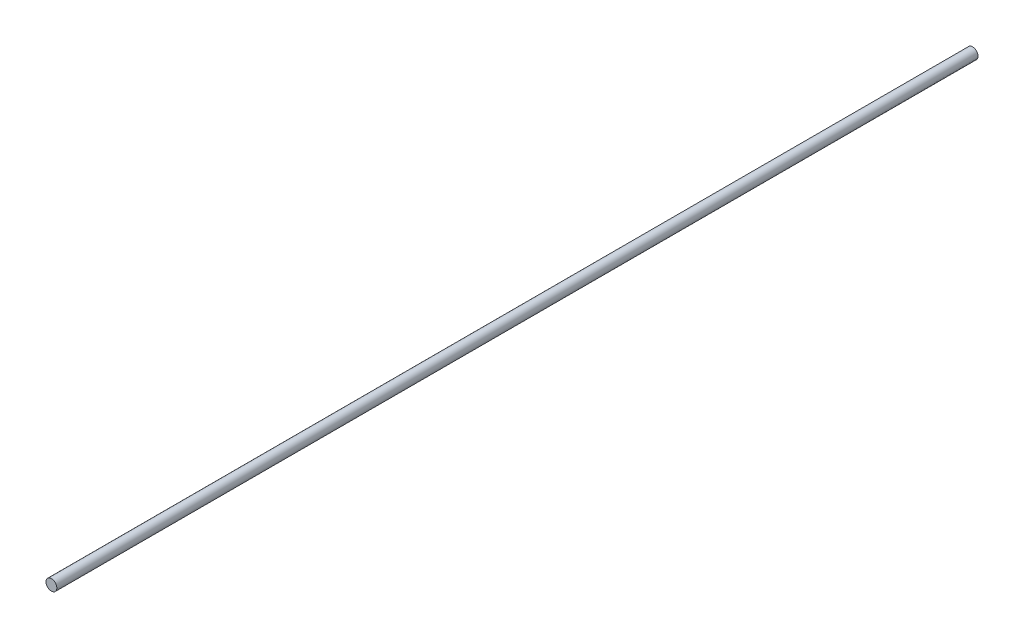
ISO-10303-21;
HEADER;
FILE_DESCRIPTION(('STEP AP214'),'2;1');
FILE_NAME('part.step','',(''),(''),'','','');
FILE_SCHEMA(('AUTOMOTIVE_DESIGN { 1 0 10303 214 1 1 1 1 }'));
ENDSEC;
DATA;
#1=APPLICATION_CONTEXT('core data for automotive mechanical design processes');
#2=APPLICATION_PROTOCOL_DEFINITION('international standard','automotive_design',2000,#1);
#3=PRODUCT_CONTEXT('',#1,'mechanical');
#4=PRODUCT('Part','Part','',(#3));
#5=PRODUCT_RELATED_PRODUCT_CATEGORY('part','',(#4));
#6=PRODUCT_DEFINITION_FORMATION('','',#4);
#7=PRODUCT_DEFINITION_CONTEXT('part definition',#1,'design');
#8=PRODUCT_DEFINITION('design','',#6,#7);
#9=PRODUCT_DEFINITION_SHAPE('','',#8);
#10=(LENGTH_UNIT() NAMED_UNIT(*) SI_UNIT(.MILLI.,.METRE.));
#11=(NAMED_UNIT(*) PLANE_ANGLE_UNIT() SI_UNIT($,.RADIAN.));
#12=(NAMED_UNIT(*) SI_UNIT($,.STERADIAN.) SOLID_ANGLE_UNIT());
#13=UNCERTAINTY_MEASURE_WITH_UNIT(LENGTH_MEASURE(1.E-05),#10,'distance_accuracy_value','');
#14=(GEOMETRIC_REPRESENTATION_CONTEXT(3) GLOBAL_UNCERTAINTY_ASSIGNED_CONTEXT((#13)) GLOBAL_UNIT_ASSIGNED_CONTEXT((#10,
#11,#12)) REPRESENTATION_CONTEXT('',''));
#15=CARTESIAN_POINT('',(0.,0.,0.));
#16=DIRECTION('',(0.,0.,1.));
#17=DIRECTION('',(1.,0.,0.));
#18=AXIS2_PLACEMENT_3D('',#15,#16,#17);
#19=CARTESIAN_POINT('',(0.,0.,680.));
#20=DIRECTION('',(0.,0.,-1.));
#21=DIRECTION('',(-1.,0.,0.));
#22=AXIS2_PLACEMENT_3D('',#19,#20,#21);
#23=CYLINDRICAL_SURFACE('',#22,4.);
#24=CARTESIAN_POINT('',(0.,0.,680.));
#25=DIRECTION('',(0.,0.,1.));
#26=DIRECTION('',(1.,0.,0.));
#27=AXIS2_PLACEMENT_3D('',#24,#25,#26);
#28=CIRCLE('',#27,4.);
#29=CARTESIAN_POINT('',(4.,0.,680.));
#30=VERTEX_POINT('',#29);
#31=EDGE_CURVE('E10',#30,#30,#28,.T.);
#32=ORIENTED_EDGE('',*,*,#31,.F.);
#33=EDGE_LOOP('',(#32));
#34=FACE_BOUND('',#33,.T.);
#35=CARTESIAN_POINT('',(0.,0.,0.));
#36=DIRECTION('',(0.,0.,1.));
#37=DIRECTION('',(1.,0.,0.));
#38=AXIS2_PLACEMENT_3D('',#35,#36,#37);
#39=CIRCLE('',#38,4.);
#40=CARTESIAN_POINT('',(4.,0.,0.));
#41=VERTEX_POINT('',#40);
#42=EDGE_CURVE('E33',#41,#41,#39,.T.);
#43=ORIENTED_EDGE('',*,*,#42,.T.);
#44=EDGE_LOOP('',(#43));
#45=FACE_BOUND('',#44,.T.);
#46=ADVANCED_FACE('F30',(#34,#45),#23,.T.);
#47=CARTESIAN_POINT('',(0.,0.,680.));
#48=DIRECTION('',(0.,0.,1.));
#49=DIRECTION('',(1.,0.,0.));
#50=AXIS2_PLACEMENT_3D('',#47,#48,#49);
#51=PLANE('',#50);
#52=ORIENTED_EDGE('',*,*,#31,.T.);
#53=EDGE_LOOP('',(#52));
#54=FACE_BOUND('',#53,.T.);
#55=ADVANCED_FACE('F45',(#54),#51,.T.);
#56=CARTESIAN_POINT('',(0.,0.,0.));
#57=DIRECTION('',(0.,0.,1.));
#58=DIRECTION('',(1.,0.,0.));
#59=AXIS2_PLACEMENT_3D('',#56,#57,#58);
#60=PLANE('',#59);
#61=ORIENTED_EDGE('',*,*,#42,.F.);
#62=EDGE_LOOP('',(#61));
#63=FACE_BOUND('',#62,.T.);
#64=ADVANCED_FACE('F43',(#63),#60,.F.);
#65=CLOSED_SHELL('',(#46,#55,#64));
#66=MANIFOLD_SOLID_BREP('B2',#65);
#67=ADVANCED_BREP_SHAPE_REPRESENTATION('',(#18,#66),#14);
#68=SHAPE_DEFINITION_REPRESENTATION(#9,#67);
ENDSEC;
END-ISO-10303-21;
